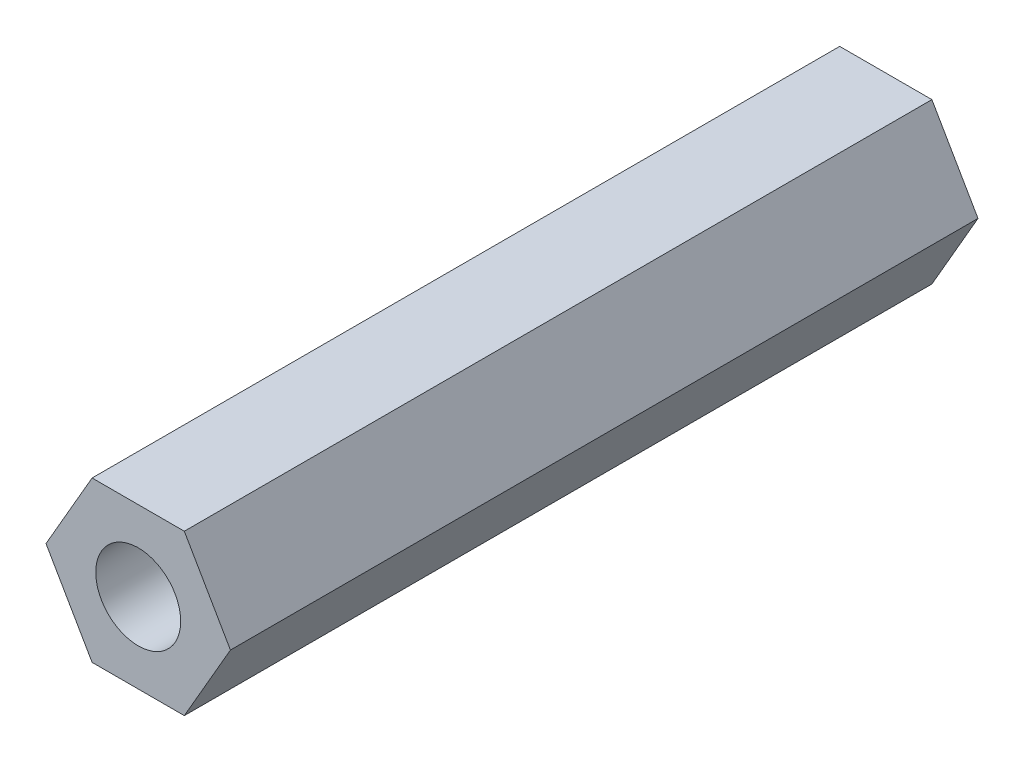
ISO-10303-21;
HEADER;
FILE_DESCRIPTION(('STEP AP214'),'2;1');
FILE_NAME('part.step','',(''),(''),'','','');
FILE_SCHEMA(('AUTOMOTIVE_DESIGN { 1 0 10303 214 1 1 1 1 }'));
ENDSEC;
DATA;
#1=APPLICATION_CONTEXT('core data for automotive mechanical design processes');
#2=APPLICATION_PROTOCOL_DEFINITION('international standard','automotive_design',2000,#1);
#3=PRODUCT_CONTEXT('',#1,'mechanical');
#4=PRODUCT('Part','Part','',(#3));
#5=PRODUCT_RELATED_PRODUCT_CATEGORY('part','',(#4));
#6=PRODUCT_DEFINITION_FORMATION('','',#4);
#7=PRODUCT_DEFINITION_CONTEXT('part definition',#1,'design');
#8=PRODUCT_DEFINITION('design','',#6,#7);
#9=PRODUCT_DEFINITION_SHAPE('','',#8);
#10=(LENGTH_UNIT() NAMED_UNIT(*) SI_UNIT(.MILLI.,.METRE.));
#11=(NAMED_UNIT(*) PLANE_ANGLE_UNIT() SI_UNIT($,.RADIAN.));
#12=(NAMED_UNIT(*) SI_UNIT($,.STERADIAN.) SOLID_ANGLE_UNIT());
#13=UNCERTAINTY_MEASURE_WITH_UNIT(LENGTH_MEASURE(1.E-05),#10,'distance_accuracy_value','');
#14=(GEOMETRIC_REPRESENTATION_CONTEXT(3) GLOBAL_UNCERTAINTY_ASSIGNED_CONTEXT((#13)) GLOBAL_UNIT_ASSIGNED_CONTEXT((#10,
#11,#12)) REPRESENTATION_CONTEXT('',''));
#15=CARTESIAN_POINT('',(0.,0.,0.));
#16=DIRECTION('',(0.,0.,1.));
#17=DIRECTION('',(1.,0.,0.));
#18=AXIS2_PLACEMENT_3D('',#15,#16,#17);
#19=CARTESIAN_POINT('',(2.71354626519124,0.,11.));
#20=DIRECTION('',(-0.866025403784439,-0.5,0.));
#21=DIRECTION('',(0.5,-0.866025403784439,0.));
#22=AXIS2_PLACEMENT_3D('',#19,#20,#21);
#23=PLANE('',#22);
#24=DIRECTION('',(-0.5,0.866025403784439,0.));
#25=VECTOR('',#24,1.);
#26=CARTESIAN_POINT('',(2.71354626519124,0.,-11.));
#27=LINE('',#26,#25);
#28=CARTESIAN_POINT('',(2.71354626519124,0.,-11.));
#29=VERTEX_POINT('',#28);
#30=CARTESIAN_POINT('',(1.35677313259562,2.35,-11.));
#31=VERTEX_POINT('',#30);
#32=EDGE_CURVE('E122',#29,#31,#27,.T.);
#33=ORIENTED_EDGE('',*,*,#32,.T.);
#34=DIRECTION('',(0.,0.,-1.));
#35=VECTOR('',#34,1.);
#36=CARTESIAN_POINT('',(1.35677313259562,2.35,11.));
#37=LINE('',#36,#35);
#38=CARTESIAN_POINT('',(1.35677313259562,2.35,11.));
#39=VERTEX_POINT('',#38);
#40=EDGE_CURVE('E11',#39,#31,#37,.T.);
#41=ORIENTED_EDGE('',*,*,#40,.F.);
#42=DIRECTION('',(-0.5,0.866025403784439,0.));
#43=VECTOR('',#42,1.);
#44=CARTESIAN_POINT('',(2.71354626519124,0.,11.));
#45=LINE('',#44,#43);
#46=CARTESIAN_POINT('',(2.71354626519124,0.,11.));
#47=VERTEX_POINT('',#46);
#48=EDGE_CURVE('E133',#47,#39,#45,.T.);
#49=ORIENTED_EDGE('',*,*,#48,.F.);
#50=DIRECTION('',(0.,0.,-1.));
#51=VECTOR('',#50,1.);
#52=CARTESIAN_POINT('',(2.71354626519124,0.,11.));
#53=LINE('',#52,#51);
#54=EDGE_CURVE('E118',#47,#29,#53,.T.);
#55=ORIENTED_EDGE('',*,*,#54,.T.);
#56=EDGE_LOOP('',(#33,#41,#49,#55));
#57=FACE_BOUND('',#56,.T.);
#58=ADVANCED_FACE('F38',(#57),#23,.F.);
#59=CARTESIAN_POINT('',(1.35677313259562,2.35,11.));
#60=DIRECTION('',(0.,-1.,0.));
#61=DIRECTION('',(1.,0.,0.));
#62=AXIS2_PLACEMENT_3D('',#59,#60,#61);
#63=PLANE('',#62);
#64=DIRECTION('',(-1.,0.,0.));
#65=VECTOR('',#64,1.);
#66=CARTESIAN_POINT('',(1.35677313259562,2.35,-11.));
#67=LINE('',#66,#65);
#68=CARTESIAN_POINT('',(-1.35677313259562,2.35,-11.));
#69=VERTEX_POINT('',#68);
#70=EDGE_CURVE('E125',#31,#69,#67,.T.);
#71=ORIENTED_EDGE('',*,*,#70,.T.);
#72=DIRECTION('',(0.,0.,-1.));
#73=VECTOR('',#72,1.);
#74=CARTESIAN_POINT('',(-1.35677313259562,2.35,11.));
#75=LINE('',#74,#73);
#76=CARTESIAN_POINT('',(-1.35677313259562,2.35,11.));
#77=VERTEX_POINT('',#76);
#78=EDGE_CURVE('E46',#77,#69,#75,.T.);
#79=ORIENTED_EDGE('',*,*,#78,.F.);
#80=DIRECTION('',(-1.,0.,0.));
#81=VECTOR('',#80,1.);
#82=CARTESIAN_POINT('',(1.35677313259562,2.35,11.));
#83=LINE('',#82,#81);
#84=EDGE_CURVE('E91',#39,#77,#83,.T.);
#85=ORIENTED_EDGE('',*,*,#84,.F.);
#86=ORIENTED_EDGE('',*,*,#40,.T.);
#87=EDGE_LOOP('',(#71,#79,#85,#86));
#88=FACE_BOUND('',#87,.T.);
#89=ADVANCED_FACE('F158',(#88),#63,.F.);
#90=CARTESIAN_POINT('',(-1.35677313259562,2.35,11.));
#91=DIRECTION('',(0.866025403784439,-0.5,0.));
#92=DIRECTION('',(0.5,0.866025403784439,0.));
#93=AXIS2_PLACEMENT_3D('',#90,#91,#92);
#94=PLANE('',#93);
#95=DIRECTION('',(-0.5,-0.866025403784439,0.));
#96=VECTOR('',#95,1.);
#97=CARTESIAN_POINT('',(-1.35677313259562,2.35,-11.));
#98=LINE('',#97,#96);
#99=CARTESIAN_POINT('',(-2.71354626519124,0.,-11.));
#100=VERTEX_POINT('',#99);
#101=EDGE_CURVE('E128',#69,#100,#98,.T.);
#102=ORIENTED_EDGE('',*,*,#101,.T.);
#103=DIRECTION('',(0.,0.,-1.));
#104=VECTOR('',#103,1.);
#105=CARTESIAN_POINT('',(-2.71354626519124,0.,11.));
#106=LINE('',#105,#104);
#107=CARTESIAN_POINT('',(-2.71354626519124,0.,11.));
#108=VERTEX_POINT('',#107);
#109=EDGE_CURVE('E113',#108,#100,#106,.T.);
#110=ORIENTED_EDGE('',*,*,#109,.F.);
#111=DIRECTION('',(-0.5,-0.866025403784439,0.));
#112=VECTOR('',#111,1.);
#113=CARTESIAN_POINT('',(-1.35677313259562,2.35,11.));
#114=LINE('',#113,#112);
#115=EDGE_CURVE('E104',#77,#108,#114,.T.);
#116=ORIENTED_EDGE('',*,*,#115,.F.);
#117=ORIENTED_EDGE('',*,*,#78,.T.);
#118=EDGE_LOOP('',(#102,#110,#116,#117));
#119=FACE_BOUND('',#118,.T.);
#120=ADVANCED_FACE('F139',(#119),#94,.F.);
#121=CARTESIAN_POINT('',(-2.71354626519124,0.,11.));
#122=DIRECTION('',(0.866025403784438,0.500000000000001,0.));
#123=DIRECTION('',(-0.500000000000001,0.866025403784438,0.));
#124=AXIS2_PLACEMENT_3D('',#121,#122,#123);
#125=PLANE('',#124);
#126=DIRECTION('',(0.5,-0.866025403784438,0.));
#127=VECTOR('',#126,1.);
#128=CARTESIAN_POINT('',(-2.71354626519124,0.,-11.));
#129=LINE('',#128,#127);
#130=CARTESIAN_POINT('',(-1.35677313259562,-2.35,-11.));
#131=VERTEX_POINT('',#130);
#132=EDGE_CURVE('E112',#100,#131,#129,.T.);
#133=ORIENTED_EDGE('',*,*,#132,.T.);
#134=DIRECTION('',(0.,0.,-1.));
#135=VECTOR('',#134,1.);
#136=CARTESIAN_POINT('',(-1.35677313259562,-2.35,11.));
#137=LINE('',#136,#135);
#138=CARTESIAN_POINT('',(-1.35677313259562,-2.35,11.));
#139=VERTEX_POINT('',#138);
#140=EDGE_CURVE('E109',#139,#131,#137,.T.);
#141=ORIENTED_EDGE('',*,*,#140,.F.);
#142=DIRECTION('',(0.5,-0.866025403784438,0.));
#143=VECTOR('',#142,1.);
#144=CARTESIAN_POINT('',(-2.71354626519124,0.,11.));
#145=LINE('',#144,#143);
#146=EDGE_CURVE('E98',#108,#139,#145,.T.);
#147=ORIENTED_EDGE('',*,*,#146,.F.);
#148=ORIENTED_EDGE('',*,*,#109,.T.);
#149=EDGE_LOOP('',(#133,#141,#147,#148));
#150=FACE_BOUND('',#149,.T.);
#151=ADVANCED_FACE('F110',(#150),#125,.F.);
#152=CARTESIAN_POINT('',(-1.35677313259562,-2.35,11.));
#153=DIRECTION('',(0.,1.,0.));
#154=DIRECTION('',(-1.,0.,0.));
#155=AXIS2_PLACEMENT_3D('',#152,#153,#154);
#156=PLANE('',#155);
#157=DIRECTION('',(1.,0.,0.));
#158=VECTOR('',#157,1.);
#159=CARTESIAN_POINT('',(-1.35677313259562,-2.35,-11.));
#160=LINE('',#159,#158);
#161=CARTESIAN_POINT('',(1.35677313259562,-2.35,-11.));
#162=VERTEX_POINT('',#161);
#163=EDGE_CURVE('E77',#131,#162,#160,.T.);
#164=ORIENTED_EDGE('',*,*,#163,.T.);
#165=DIRECTION('',(0.,0.,-1.));
#166=VECTOR('',#165,1.);
#167=CARTESIAN_POINT('',(1.35677313259562,-2.35,11.));
#168=LINE('',#167,#166);
#169=CARTESIAN_POINT('',(1.35677313259562,-2.35,11.));
#170=VERTEX_POINT('',#169);
#171=EDGE_CURVE('E114',#170,#162,#168,.T.);
#172=ORIENTED_EDGE('',*,*,#171,.F.);
#173=DIRECTION('',(1.,0.,0.));
#174=VECTOR('',#173,1.);
#175=CARTESIAN_POINT('',(-1.35677313259562,-2.35,11.));
#176=LINE('',#175,#174);
#177=EDGE_CURVE('E102',#139,#170,#176,.T.);
#178=ORIENTED_EDGE('',*,*,#177,.F.);
#179=ORIENTED_EDGE('',*,*,#140,.T.);
#180=EDGE_LOOP('',(#164,#172,#178,#179));
#181=FACE_BOUND('',#180,.T.);
#182=ADVANCED_FACE('F116',(#181),#156,.F.);
#183=CARTESIAN_POINT('',(1.35677313259562,-2.35,11.));
#184=DIRECTION('',(-0.866025403784439,0.5,0.));
#185=DIRECTION('',(-0.5,-0.866025403784439,0.));
#186=AXIS2_PLACEMENT_3D('',#183,#184,#185);
#187=PLANE('',#186);
#188=DIRECTION('',(0.5,0.866025403784439,0.));
#189=VECTOR('',#188,1.);
#190=CARTESIAN_POINT('',(1.35677313259562,-2.35,-11.));
#191=LINE('',#190,#189);
#192=EDGE_CURVE('E83',#162,#29,#191,.T.);
#193=ORIENTED_EDGE('',*,*,#192,.T.);
#194=ORIENTED_EDGE('',*,*,#54,.F.);
#195=DIRECTION('',(0.5,0.866025403784439,0.));
#196=VECTOR('',#195,1.);
#197=CARTESIAN_POINT('',(1.35677313259562,-2.35,11.));
#198=LINE('',#197,#196);
#199=EDGE_CURVE('E54',#170,#47,#198,.T.);
#200=ORIENTED_EDGE('',*,*,#199,.F.);
#201=ORIENTED_EDGE('',*,*,#171,.T.);
#202=EDGE_LOOP('',(#193,#194,#200,#201));
#203=FACE_BOUND('',#202,.T.);
#204=ADVANCED_FACE('F146',(#203),#187,.F.);
#205=CARTESIAN_POINT('',(0.,0.,11.));
#206=DIRECTION('',(0.,0.,1.));
#207=DIRECTION('',(1.,0.,0.));
#208=AXIS2_PLACEMENT_3D('',#205,#206,#207);
#209=PLANE('',#208);
#210=CARTESIAN_POINT('',(0.,0.,11.));
#211=DIRECTION('',(0.,0.,1.));
#212=DIRECTION('',(1.,0.,0.));
#213=AXIS2_PLACEMENT_3D('',#210,#211,#212);
#214=CIRCLE('',#213,1.25);
#215=CARTESIAN_POINT('',(1.25,0.,11.));
#216=VERTEX_POINT('',#215);
#217=EDGE_CURVE('E220',#216,#216,#214,.T.);
#218=ORIENTED_EDGE('',*,*,#217,.F.);
#219=EDGE_LOOP('',(#218));
#220=FACE_BOUND('',#219,.T.);
#221=ORIENTED_EDGE('',*,*,#48,.T.);
#222=ORIENTED_EDGE('',*,*,#84,.T.);
#223=ORIENTED_EDGE('',*,*,#115,.T.);
#224=ORIENTED_EDGE('',*,*,#146,.T.);
#225=ORIENTED_EDGE('',*,*,#177,.T.);
#226=ORIENTED_EDGE('',*,*,#199,.T.);
#227=EDGE_LOOP('',(#221,#222,#223,#224,#225,#226));
#228=FACE_BOUND('',#227,.T.);
#229=ADVANCED_FACE('F100',(#220,#228),#209,.T.);
#230=CARTESIAN_POINT('',(0.,0.,-11.));
#231=DIRECTION('',(0.,0.,1.));
#232=DIRECTION('',(1.,0.,0.));
#233=AXIS2_PLACEMENT_3D('',#230,#231,#232);
#234=PLANE('',#233);
#235=CARTESIAN_POINT('',(0.,0.,-11.));
#236=DIRECTION('',(0.,0.,1.));
#237=DIRECTION('',(1.,0.,0.));
#238=AXIS2_PLACEMENT_3D('',#235,#236,#237);
#239=CIRCLE('',#238,1.24999999999999);
#240=CARTESIAN_POINT('',(1.24999999999999,0.,-11.));
#241=VERTEX_POINT('',#240);
#242=EDGE_CURVE('E126',#241,#241,#239,.T.);
#243=ORIENTED_EDGE('',*,*,#242,.T.);
#244=EDGE_LOOP('',(#243));
#245=FACE_BOUND('',#244,.T.);
#246=ORIENTED_EDGE('',*,*,#32,.F.);
#247=ORIENTED_EDGE('',*,*,#192,.F.);
#248=ORIENTED_EDGE('',*,*,#163,.F.);
#249=ORIENTED_EDGE('',*,*,#132,.F.);
#250=ORIENTED_EDGE('',*,*,#101,.F.);
#251=ORIENTED_EDGE('',*,*,#70,.F.);
#252=EDGE_LOOP('',(#246,#247,#248,#249,#250,#251));
#253=FACE_BOUND('',#252,.T.);
#254=ADVANCED_FACE('F142',(#245,#253),#234,.F.);
#255=CARTESIAN_POINT('',(0.,0.,11.));
#256=DIRECTION('',(0.,0.,1.));
#257=DIRECTION('',(1.,0.,0.));
#258=AXIS2_PLACEMENT_3D('',#255,#256,#257);
#259=CYLINDRICAL_SURFACE('',#258,1.25);
#260=ORIENTED_EDGE('',*,*,#242,.F.);
#261=EDGE_LOOP('',(#260));
#262=FACE_BOUND('',#261,.T.);
#263=ORIENTED_EDGE('',*,*,#217,.T.);
#264=EDGE_LOOP('',(#263));
#265=FACE_BOUND('',#264,.T.);
#266=ADVANCED_FACE('F198',(#262,#265),#259,.F.);
#267=CLOSED_SHELL('',(#58,#89,#120,#151,#182,#204,#229,#254,#266));
#268=MANIFOLD_SOLID_BREP('B2',#267);
#269=ADVANCED_BREP_SHAPE_REPRESENTATION('',(#18,#268),#14);
#270=SHAPE_DEFINITION_REPRESENTATION(#9,#269);
ENDSEC;
END-ISO-10303-21;
